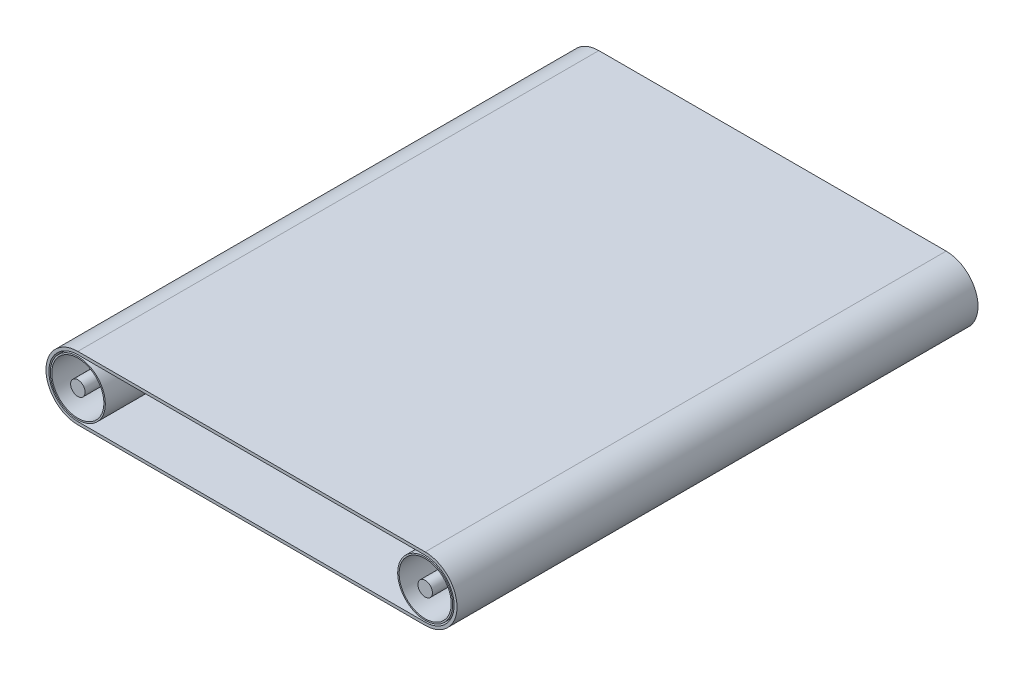
ISO-10303-21;
HEADER;
FILE_DESCRIPTION(('STEP AP214'),'2;1');
FILE_NAME('part.step','',(''),(''),'','','');
FILE_SCHEMA(('AUTOMOTIVE_DESIGN { 1 0 10303 214 1 1 1 1 }'));
ENDSEC;
DATA;
#1=APPLICATION_CONTEXT('core data for automotive mechanical design processes');
#2=APPLICATION_PROTOCOL_DEFINITION('international standard','automotive_design',2000,#1);
#3=PRODUCT_CONTEXT('',#1,'mechanical');
#4=PRODUCT('Part','Part','',(#3));
#5=PRODUCT_RELATED_PRODUCT_CATEGORY('part','',(#4));
#6=PRODUCT_DEFINITION_FORMATION('','',#4);
#7=PRODUCT_DEFINITION_CONTEXT('part definition',#1,'design');
#8=PRODUCT_DEFINITION('design','',#6,#7);
#9=PRODUCT_DEFINITION_SHAPE('','',#8);
#10=(LENGTH_UNIT() NAMED_UNIT(*) SI_UNIT(.MILLI.,.METRE.));
#11=(NAMED_UNIT(*) PLANE_ANGLE_UNIT() SI_UNIT($,.RADIAN.));
#12=(NAMED_UNIT(*) SI_UNIT($,.STERADIAN.) SOLID_ANGLE_UNIT());
#13=UNCERTAINTY_MEASURE_WITH_UNIT(LENGTH_MEASURE(1.E-05),#10,'distance_accuracy_value','');
#14=(GEOMETRIC_REPRESENTATION_CONTEXT(3) GLOBAL_UNCERTAINTY_ASSIGNED_CONTEXT((#13)) GLOBAL_UNIT_ASSIGNED_CONTEXT((#10,
#11,#12)) REPRESENTATION_CONTEXT('',''));
#15=CARTESIAN_POINT('',(0.,0.,0.));
#16=DIRECTION('',(0.,0.,1.));
#17=DIRECTION('',(1.,0.,0.));
#18=AXIS2_PLACEMENT_3D('',#15,#16,#17);
#19=CARTESIAN_POINT('',(120.,10.,0.));
#20=DIRECTION('',(0.,0.,1.));
#21=DIRECTION('',(1.,0.,0.));
#22=AXIS2_PLACEMENT_3D('',#19,#20,#21);
#23=CYLINDRICAL_SURFACE('',#22,9.5);
#24=CARTESIAN_POINT('',(120.,10.,0.));
#25=DIRECTION('',(0.,0.,1.));
#26=DIRECTION('',(-1.,0.,0.));
#27=AXIS2_PLACEMENT_3D('',#24,#25,#26);
#28=CIRCLE('',#27,9.5);
#29=CARTESIAN_POINT('',(110.5,10.,0.));
#30=VERTEX_POINT('',#29);
#31=EDGE_CURVE('E61',#30,#30,#28,.T.);
#32=ORIENTED_EDGE('',*,*,#31,.T.);
#33=EDGE_LOOP('',(#32));
#34=FACE_BOUND('',#33,.T.);
#35=CARTESIAN_POINT('',(120.,10.,180.));
#36=DIRECTION('',(0.,0.,1.));
#37=DIRECTION('',(-1.,0.,0.));
#38=AXIS2_PLACEMENT_3D('',#35,#36,#37);
#39=CIRCLE('',#38,9.5);
#40=CARTESIAN_POINT('',(110.5,10.,180.));
#41=VERTEX_POINT('',#40);
#42=EDGE_CURVE('E59',#41,#41,#39,.T.);
#43=ORIENTED_EDGE('',*,*,#42,.F.);
#44=EDGE_LOOP('',(#43));
#45=FACE_BOUND('',#44,.T.);
#46=ADVANCED_FACE('F48',(#34,#45),#23,.T.);
#47=CARTESIAN_POINT('',(120.,10.,0.));
#48=DIRECTION('',(0.,0.,-1.));
#49=DIRECTION('',(-1.,0.,0.));
#50=AXIS2_PLACEMENT_3D('',#47,#48,#49);
#51=PLANE('',#50);
#52=CARTESIAN_POINT('',(120.,10.,0.));
#53=DIRECTION('',(0.,0.,1.));
#54=DIRECTION('',(-1.,0.,0.));
#55=AXIS2_PLACEMENT_3D('',#52,#53,#54);
#56=CIRCLE('',#55,9.00000000000005);
#57=CARTESIAN_POINT('',(111.,10.,0.));
#58=VERTEX_POINT('',#57);
#59=EDGE_CURVE('E52',#58,#58,#56,.T.);
#60=ORIENTED_EDGE('',*,*,#59,.T.);
#61=EDGE_LOOP('',(#60));
#62=FACE_BOUND('',#61,.T.);
#63=ORIENTED_EDGE('',*,*,#31,.F.);
#64=EDGE_LOOP('',(#63));
#65=FACE_BOUND('',#64,.T.);
#66=ADVANCED_FACE('F70',(#62,#65),#51,.T.);
#67=CARTESIAN_POINT('',(120.,10.,180.));
#68=DIRECTION('',(0.,0.,-1.));
#69=DIRECTION('',(-1.,0.,0.));
#70=AXIS2_PLACEMENT_3D('',#67,#68,#69);
#71=PLANE('',#70);
#72=CARTESIAN_POINT('',(120.,10.,180.));
#73=DIRECTION('',(0.,0.,1.));
#74=DIRECTION('',(-1.,0.,0.));
#75=AXIS2_PLACEMENT_3D('',#72,#73,#74);
#76=CIRCLE('',#75,9.00000000000005);
#77=CARTESIAN_POINT('',(111.,10.,180.));
#78=VERTEX_POINT('',#77);
#79=EDGE_CURVE('E11',#78,#78,#76,.T.);
#80=ORIENTED_EDGE('',*,*,#79,.F.);
#81=EDGE_LOOP('',(#80));
#82=FACE_BOUND('',#81,.T.);
#83=ORIENTED_EDGE('',*,*,#42,.T.);
#84=EDGE_LOOP('',(#83));
#85=FACE_BOUND('',#84,.T.);
#86=ADVANCED_FACE('F67',(#82,#85),#71,.F.);
#87=CARTESIAN_POINT('',(120.,10.,0.));
#88=DIRECTION('',(0.,0.,1.));
#89=DIRECTION('',(1.,0.,0.));
#90=AXIS2_PLACEMENT_3D('',#87,#88,#89);
#91=CYLINDRICAL_SURFACE('',#90,9.00000000000005);
#92=ORIENTED_EDGE('',*,*,#59,.F.);
#93=EDGE_LOOP('',(#92));
#94=FACE_BOUND('',#93,.T.);
#95=ORIENTED_EDGE('',*,*,#79,.T.);
#96=EDGE_LOOP('',(#95));
#97=FACE_BOUND('',#96,.T.);
#98=ADVANCED_FACE('F50',(#94,#97),#91,.F.);
#99=CLOSED_SHELL('',(#46,#66,#86,#98));
#100=MANIFOLD_SOLID_BREP('B2',#99);
#101=CARTESIAN_POINT('',(0.,10.,0.));
#102=DIRECTION('',(0.,0.,1.));
#103=DIRECTION('',(1.,0.,0.));
#104=AXIS2_PLACEMENT_3D('',#101,#102,#103);
#105=CYLINDRICAL_SURFACE('',#104,9.5);
#106=CARTESIAN_POINT('',(0.,10.,0.));
#107=DIRECTION('',(0.,0.,1.));
#108=DIRECTION('',(1.,0.,0.));
#109=AXIS2_PLACEMENT_3D('',#106,#107,#108);
#110=CIRCLE('',#109,9.5);
#111=CARTESIAN_POINT('',(9.5,10.,0.));
#112=VERTEX_POINT('',#111);
#113=EDGE_CURVE('E47',#112,#112,#110,.T.);
#114=ORIENTED_EDGE('',*,*,#113,.T.);
#115=EDGE_LOOP('',(#114));
#116=FACE_BOUND('',#115,.T.);
#117=CARTESIAN_POINT('',(0.,10.,180.));
#118=DIRECTION('',(0.,0.,1.));
#119=DIRECTION('',(1.,0.,0.));
#120=AXIS2_PLACEMENT_3D('',#117,#118,#119);
#121=CIRCLE('',#120,9.5);
#122=CARTESIAN_POINT('',(9.5,10.,180.));
#123=VERTEX_POINT('',#122);
#124=EDGE_CURVE('E129',#123,#123,#121,.T.);
#125=ORIENTED_EDGE('',*,*,#124,.F.);
#126=EDGE_LOOP('',(#125));
#127=FACE_BOUND('',#126,.T.);
#128=ADVANCED_FACE('F126',(#116,#127),#105,.T.);
#129=CARTESIAN_POINT('',(0.,10.,0.));
#130=DIRECTION('',(0.,0.,1.));
#131=DIRECTION('',(1.,0.,0.));
#132=AXIS2_PLACEMENT_3D('',#129,#130,#131);
#133=PLANE('',#132);
#134=CARTESIAN_POINT('',(0.,10.,0.));
#135=DIRECTION('',(0.,0.,1.));
#136=DIRECTION('',(1.,0.,0.));
#137=AXIS2_PLACEMENT_3D('',#134,#135,#136);
#138=CIRCLE('',#137,9.);
#139=CARTESIAN_POINT('',(9.,10.,0.));
#140=VERTEX_POINT('',#139);
#141=EDGE_CURVE('E136',#140,#140,#138,.T.);
#142=ORIENTED_EDGE('',*,*,#141,.T.);
#143=EDGE_LOOP('',(#142));
#144=FACE_BOUND('',#143,.T.);
#145=ORIENTED_EDGE('',*,*,#113,.F.);
#146=EDGE_LOOP('',(#145));
#147=FACE_BOUND('',#146,.T.);
#148=ADVANCED_FACE('F144',(#144,#147),#133,.F.);
#149=CARTESIAN_POINT('',(0.,10.,180.));
#150=DIRECTION('',(0.,0.,1.));
#151=DIRECTION('',(1.,0.,0.));
#152=AXIS2_PLACEMENT_3D('',#149,#150,#151);
#153=PLANE('',#152);
#154=CARTESIAN_POINT('',(0.,10.,180.));
#155=DIRECTION('',(0.,0.,1.));
#156=DIRECTION('',(1.,0.,0.));
#157=AXIS2_PLACEMENT_3D('',#154,#155,#156);
#158=CIRCLE('',#157,9.);
#159=CARTESIAN_POINT('',(9.,10.,180.));
#160=VERTEX_POINT('',#159);
#161=EDGE_CURVE('E138',#160,#160,#158,.T.);
#162=ORIENTED_EDGE('',*,*,#161,.F.);
#163=EDGE_LOOP('',(#162));
#164=FACE_BOUND('',#163,.T.);
#165=ORIENTED_EDGE('',*,*,#124,.T.);
#166=EDGE_LOOP('',(#165));
#167=FACE_BOUND('',#166,.T.);
#168=ADVANCED_FACE('F150',(#164,#167),#153,.T.);
#169=CARTESIAN_POINT('',(0.,10.,0.));
#170=DIRECTION('',(0.,0.,1.));
#171=DIRECTION('',(1.,0.,0.));
#172=AXIS2_PLACEMENT_3D('',#169,#170,#171);
#173=CYLINDRICAL_SURFACE('',#172,9.);
#174=ORIENTED_EDGE('',*,*,#141,.F.);
#175=EDGE_LOOP('',(#174));
#176=FACE_BOUND('',#175,.T.);
#177=ORIENTED_EDGE('',*,*,#161,.T.);
#178=EDGE_LOOP('',(#177));
#179=FACE_BOUND('',#178,.T.);
#180=ADVANCED_FACE('F147',(#176,#179),#173,.F.);
#181=CLOSED_SHELL('',(#128,#148,#168,#180));
#182=MANIFOLD_SOLID_BREP('B6',#181);
#183=CARTESIAN_POINT('',(120.,10.,0.));
#184=DIRECTION('',(0.,0.,1.));
#185=DIRECTION('',(1.,0.,0.));
#186=AXIS2_PLACEMENT_3D('',#183,#184,#185);
#187=CYLINDRICAL_SURFACE('',#186,2.49999999999997);
#188=CARTESIAN_POINT('',(120.,10.,0.));
#189=DIRECTION('',(0.,0.,1.));
#190=DIRECTION('',(-1.,0.,0.));
#191=AXIS2_PLACEMENT_3D('',#188,#189,#190);
#192=CIRCLE('',#191,2.49999999999997);
#193=CARTESIAN_POINT('',(117.5,10.,0.));
#194=VERTEX_POINT('',#193);
#195=EDGE_CURVE('E208',#194,#194,#192,.T.);
#196=ORIENTED_EDGE('',*,*,#195,.T.);
#197=EDGE_LOOP('',(#196));
#198=FACE_BOUND('',#197,.T.);
#199=CARTESIAN_POINT('',(120.,10.,180.));
#200=DIRECTION('',(0.,0.,1.));
#201=DIRECTION('',(-1.,0.,0.));
#202=AXIS2_PLACEMENT_3D('',#199,#200,#201);
#203=CIRCLE('',#202,2.49999999999997);
#204=CARTESIAN_POINT('',(117.5,10.,180.));
#205=VERTEX_POINT('',#204);
#206=EDGE_CURVE('E125',#205,#205,#203,.T.);
#207=ORIENTED_EDGE('',*,*,#206,.F.);
#208=EDGE_LOOP('',(#207));
#209=FACE_BOUND('',#208,.T.);
#210=ADVANCED_FACE('F204',(#198,#209),#187,.T.);
#211=CARTESIAN_POINT('',(120.,10.,0.));
#212=DIRECTION('',(0.,0.,-1.));
#213=DIRECTION('',(-1.,0.,0.));
#214=AXIS2_PLACEMENT_3D('',#211,#212,#213);
#215=PLANE('',#214);
#216=ORIENTED_EDGE('',*,*,#195,.F.);
#217=EDGE_LOOP('',(#216));
#218=FACE_BOUND('',#217,.T.);
#219=ADVANCED_FACE('F206',(#218),#215,.T.);
#220=CARTESIAN_POINT('',(120.,10.,180.));
#221=DIRECTION('',(0.,0.,-1.));
#222=DIRECTION('',(-1.,0.,0.));
#223=AXIS2_PLACEMENT_3D('',#220,#221,#222);
#224=PLANE('',#223);
#225=ORIENTED_EDGE('',*,*,#206,.T.);
#226=EDGE_LOOP('',(#225));
#227=FACE_BOUND('',#226,.T.);
#228=ADVANCED_FACE('F220',(#227),#224,.F.);
#229=CLOSED_SHELL('',(#210,#219,#228));
#230=MANIFOLD_SOLID_BREP('B42',#229);
#231=CARTESIAN_POINT('',(0.,10.,0.));
#232=DIRECTION('',(0.,0.,1.));
#233=DIRECTION('',(1.,0.,0.));
#234=AXIS2_PLACEMENT_3D('',#231,#232,#233);
#235=CYLINDRICAL_SURFACE('',#234,2.5);
#236=CARTESIAN_POINT('',(0.,10.,0.));
#237=DIRECTION('',(0.,0.,1.));
#238=DIRECTION('',(1.,0.,0.));
#239=AXIS2_PLACEMENT_3D('',#236,#237,#238);
#240=CIRCLE('',#239,2.5);
#241=CARTESIAN_POINT('',(2.5,10.,0.));
#242=VERTEX_POINT('',#241);
#243=EDGE_CURVE('E203',#242,#242,#240,.T.);
#244=ORIENTED_EDGE('',*,*,#243,.T.);
#245=EDGE_LOOP('',(#244));
#246=FACE_BOUND('',#245,.T.);
#247=CARTESIAN_POINT('',(0.,10.,180.));
#248=DIRECTION('',(0.,0.,1.));
#249=DIRECTION('',(1.,0.,0.));
#250=AXIS2_PLACEMENT_3D('',#247,#248,#249);
#251=CIRCLE('',#250,2.5);
#252=CARTESIAN_POINT('',(2.5,10.,180.));
#253=VERTEX_POINT('',#252);
#254=EDGE_CURVE('E263',#253,#253,#251,.T.);
#255=ORIENTED_EDGE('',*,*,#254,.F.);
#256=EDGE_LOOP('',(#255));
#257=FACE_BOUND('',#256,.T.);
#258=ADVANCED_FACE('F260',(#246,#257),#235,.T.);
#259=CARTESIAN_POINT('',(0.,10.,0.));
#260=DIRECTION('',(0.,0.,1.));
#261=DIRECTION('',(1.,0.,0.));
#262=AXIS2_PLACEMENT_3D('',#259,#260,#261);
#263=PLANE('',#262);
#264=ORIENTED_EDGE('',*,*,#243,.F.);
#265=EDGE_LOOP('',(#264));
#266=FACE_BOUND('',#265,.T.);
#267=ADVANCED_FACE('F275',(#266),#263,.F.);
#268=CARTESIAN_POINT('',(0.,10.,180.));
#269=DIRECTION('',(0.,0.,1.));
#270=DIRECTION('',(1.,0.,0.));
#271=AXIS2_PLACEMENT_3D('',#268,#269,#270);
#272=PLANE('',#271);
#273=ORIENTED_EDGE('',*,*,#254,.T.);
#274=EDGE_LOOP('',(#273));
#275=FACE_BOUND('',#274,.T.);
#276=ADVANCED_FACE('F272',(#275),#272,.T.);
#277=CLOSED_SHELL('',(#258,#267,#276));
#278=MANIFOLD_SOLID_BREP('B120',#277);
#279=CARTESIAN_POINT('',(0.,9.99999999999996,180.));
#280=DIRECTION('',(0.,0.,-1.));
#281=DIRECTION('',(-1.,0.,0.));
#282=AXIS2_PLACEMENT_3D('',#279,#280,#281);
#283=PLANE('',#282);
#284=CARTESIAN_POINT('',(0.,9.99999999999996,180.));
#285=DIRECTION('',(0.,0.,1.));
#286=DIRECTION('',(-1.,0.,0.));
#287=AXIS2_PLACEMENT_3D('',#284,#285,#286);
#288=CIRCLE('',#287,11.);
#289=CARTESIAN_POINT('',(0.,21.,180.));
#290=VERTEX_POINT('',#289);
#291=CARTESIAN_POINT('',(0.,-1.00000000000004,180.));
#292=VERTEX_POINT('',#291);
#293=EDGE_CURVE('E408',#290,#292,#288,.T.);
#294=ORIENTED_EDGE('',*,*,#293,.T.);
#295=DIRECTION('',(1.,0.,0.));
#296=VECTOR('',#295,1.);
#297=CARTESIAN_POINT('',(120.,-1.,180.));
#298=LINE('',#297,#296);
#299=CARTESIAN_POINT('',(120.,-0.999999999999999,180.));
#300=VERTEX_POINT('',#299);
#301=EDGE_CURVE('E411',#292,#300,#298,.T.);
#302=ORIENTED_EDGE('',*,*,#301,.T.);
#303=CARTESIAN_POINT('',(120.,9.99999999999999,180.));
#304=DIRECTION('',(0.,0.,1.));
#305=DIRECTION('',(-1.,0.,0.));
#306=AXIS2_PLACEMENT_3D('',#303,#304,#305);
#307=CIRCLE('',#306,11.);
#308=CARTESIAN_POINT('',(120.,21.,180.));
#309=VERTEX_POINT('',#308);
#310=EDGE_CURVE('E414',#300,#309,#307,.T.);
#311=ORIENTED_EDGE('',*,*,#310,.T.);
#312=DIRECTION('',(-1.,0.,0.));
#313=VECTOR('',#312,1.);
#314=CARTESIAN_POINT('',(0.,21.,180.));
#315=LINE('',#314,#313);
#316=EDGE_CURVE('E416',#309,#290,#315,.T.);
#317=ORIENTED_EDGE('',*,*,#316,.T.);
#318=EDGE_LOOP('',(#294,#302,#311,#317));
#319=FACE_BOUND('',#318,.T.);
#320=CARTESIAN_POINT('',(0.,10.,180.));
#321=DIRECTION('',(0.,0.,1.));
#322=DIRECTION('',(1.,0.,0.));
#323=AXIS2_PLACEMENT_3D('',#320,#321,#322);
#324=CIRCLE('',#323,10.);
#325=CARTESIAN_POINT('',(0.,20.,180.));
#326=VERTEX_POINT('',#325);
#327=CARTESIAN_POINT('',(0.,0.,180.));
#328=VERTEX_POINT('',#327);
#329=EDGE_CURVE('E372',#326,#328,#324,.T.);
#330=ORIENTED_EDGE('',*,*,#329,.F.);
#331=DIRECTION('',(-1.,0.,0.));
#332=VECTOR('',#331,1.);
#333=CARTESIAN_POINT('',(120.,20.,180.));
#334=LINE('',#333,#332);
#335=CARTESIAN_POINT('',(120.,20.,180.));
#336=VERTEX_POINT('',#335);
#337=EDGE_CURVE('E394',#336,#326,#334,.T.);
#338=ORIENTED_EDGE('',*,*,#337,.F.);
#339=CARTESIAN_POINT('',(120.,10.,180.));
#340=DIRECTION('',(0.,0.,1.));
#341=DIRECTION('',(1.,0.,0.));
#342=AXIS2_PLACEMENT_3D('',#339,#340,#341);
#343=CIRCLE('',#342,10.);
#344=CARTESIAN_POINT('',(120.,0.,180.));
#345=VERTEX_POINT('',#344);
#346=EDGE_CURVE('E392',#345,#336,#343,.T.);
#347=ORIENTED_EDGE('',*,*,#346,.F.);
#348=DIRECTION('',(1.,0.,0.));
#349=VECTOR('',#348,1.);
#350=CARTESIAN_POINT('',(0.,0.,180.));
#351=LINE('',#350,#349);
#352=EDGE_CURVE('E380',#328,#345,#351,.T.);
#353=ORIENTED_EDGE('',*,*,#352,.F.);
#354=EDGE_LOOP('',(#330,#338,#347,#353));
#355=FACE_BOUND('',#354,.T.);
#356=ADVANCED_FACE('F307',(#319,#355),#283,.F.);
#357=CARTESIAN_POINT('',(0.,9.99999999999996,0.));
#358=DIRECTION('',(0.,0.,-1.));
#359=DIRECTION('',(-1.,0.,0.));
#360=AXIS2_PLACEMENT_3D('',#357,#358,#359);
#361=PLANE('',#360);
#362=CARTESIAN_POINT('',(0.,9.99999999999996,0.));
#363=DIRECTION('',(0.,0.,1.));
#364=DIRECTION('',(-1.,0.,0.));
#365=AXIS2_PLACEMENT_3D('',#362,#363,#364);
#366=CIRCLE('',#365,11.);
#367=CARTESIAN_POINT('',(0.,21.,0.));
#368=VERTEX_POINT('',#367);
#369=CARTESIAN_POINT('',(0.,-1.00000000000004,0.));
#370=VERTEX_POINT('',#369);
#371=EDGE_CURVE('E388',#368,#370,#366,.T.);
#372=ORIENTED_EDGE('',*,*,#371,.F.);
#373=DIRECTION('',(-1.,0.,0.));
#374=VECTOR('',#373,1.);
#375=CARTESIAN_POINT('',(0.,21.,0.));
#376=LINE('',#375,#374);
#377=CARTESIAN_POINT('',(120.,21.,0.));
#378=VERTEX_POINT('',#377);
#379=EDGE_CURVE('E412',#378,#368,#376,.T.);
#380=ORIENTED_EDGE('',*,*,#379,.F.);
#381=CARTESIAN_POINT('',(120.,9.99999999999999,0.));
#382=DIRECTION('',(0.,0.,1.));
#383=DIRECTION('',(-1.,0.,0.));
#384=AXIS2_PLACEMENT_3D('',#381,#382,#383);
#385=CIRCLE('',#384,11.);
#386=CARTESIAN_POINT('',(120.,-0.999999999999999,0.));
#387=VERTEX_POINT('',#386);
#388=EDGE_CURVE('E423',#387,#378,#385,.T.);
#389=ORIENTED_EDGE('',*,*,#388,.F.);
#390=DIRECTION('',(1.,0.,0.));
#391=VECTOR('',#390,1.);
#392=CARTESIAN_POINT('',(120.,-1.,0.));
#393=LINE('',#392,#391);
#394=EDGE_CURVE('E421',#370,#387,#393,.T.);
#395=ORIENTED_EDGE('',*,*,#394,.F.);
#396=EDGE_LOOP('',(#372,#380,#389,#395));
#397=FACE_BOUND('',#396,.T.);
#398=DIRECTION('',(-1.,0.,0.));
#399=VECTOR('',#398,1.);
#400=CARTESIAN_POINT('',(120.,20.,0.));
#401=LINE('',#400,#399);
#402=CARTESIAN_POINT('',(120.,20.,0.));
#403=VERTEX_POINT('',#402);
#404=CARTESIAN_POINT('',(0.,20.,0.));
#405=VERTEX_POINT('',#404);
#406=EDGE_CURVE('E381',#403,#405,#401,.T.);
#407=ORIENTED_EDGE('',*,*,#406,.T.);
#408=CARTESIAN_POINT('',(0.,10.,0.));
#409=DIRECTION('',(0.,0.,1.));
#410=DIRECTION('',(1.,0.,0.));
#411=AXIS2_PLACEMENT_3D('',#408,#409,#410);
#412=CIRCLE('',#411,10.);
#413=CARTESIAN_POINT('',(0.,0.,0.));
#414=VERTEX_POINT('',#413);
#415=EDGE_CURVE('E330',#405,#414,#412,.T.);
#416=ORIENTED_EDGE('',*,*,#415,.T.);
#417=DIRECTION('',(1.,0.,0.));
#418=VECTOR('',#417,1.);
#419=CARTESIAN_POINT('',(0.,0.,0.));
#420=LINE('',#419,#418);
#421=CARTESIAN_POINT('',(120.,0.,0.));
#422=VERTEX_POINT('',#421);
#423=EDGE_CURVE('E387',#414,#422,#420,.T.);
#424=ORIENTED_EDGE('',*,*,#423,.T.);
#425=CARTESIAN_POINT('',(120.,10.,0.));
#426=DIRECTION('',(0.,0.,1.));
#427=DIRECTION('',(1.,0.,0.));
#428=AXIS2_PLACEMENT_3D('',#425,#426,#427);
#429=CIRCLE('',#428,10.);
#430=EDGE_CURVE('E400',#422,#403,#429,.T.);
#431=ORIENTED_EDGE('',*,*,#430,.T.);
#432=EDGE_LOOP('',(#407,#416,#424,#431));
#433=FACE_BOUND('',#432,.T.);
#434=ADVANCED_FACE('F441',(#397,#433),#361,.T.);
#435=CARTESIAN_POINT('',(0.,9.99999999999996,180.));
#436=DIRECTION('',(0.,0.,-1.));
#437=DIRECTION('',(-1.,0.,0.));
#438=AXIS2_PLACEMENT_3D('',#435,#436,#437);
#439=CYLINDRICAL_SURFACE('',#438,11.);
#440=ORIENTED_EDGE('',*,*,#371,.T.);
#441=DIRECTION('',(0.,0.,-1.));
#442=VECTOR('',#441,1.);
#443=CARTESIAN_POINT('',(0.,-1.00000000000004,180.));
#444=LINE('',#443,#442);
#445=EDGE_CURVE('E258',#292,#370,#444,.T.);
#446=ORIENTED_EDGE('',*,*,#445,.F.);
#447=ORIENTED_EDGE('',*,*,#293,.F.);
#448=DIRECTION('',(0.,0.,-1.));
#449=VECTOR('',#448,1.);
#450=CARTESIAN_POINT('',(0.,21.,180.));
#451=LINE('',#450,#449);
#452=EDGE_CURVE('E418',#290,#368,#451,.T.);
#453=ORIENTED_EDGE('',*,*,#452,.T.);
#454=EDGE_LOOP('',(#440,#446,#447,#453));
#455=FACE_BOUND('',#454,.T.);
#456=ADVANCED_FACE('F309',(#455),#439,.T.);
#457=CARTESIAN_POINT('',(120.,-1.,180.));
#458=DIRECTION('',(0.,1.,0.));
#459=DIRECTION('',(-1.,0.,0.));
#460=AXIS2_PLACEMENT_3D('',#457,#458,#459);
#461=PLANE('',#460);
#462=ORIENTED_EDGE('',*,*,#394,.T.);
#463=DIRECTION('',(0.,0.,-1.));
#464=VECTOR('',#463,1.);
#465=CARTESIAN_POINT('',(120.,-0.999999999999999,180.));
#466=LINE('',#465,#464);
#467=EDGE_CURVE('E315',#300,#387,#466,.T.);
#468=ORIENTED_EDGE('',*,*,#467,.F.);
#469=ORIENTED_EDGE('',*,*,#301,.F.);
#470=ORIENTED_EDGE('',*,*,#445,.T.);
#471=EDGE_LOOP('',(#462,#468,#469,#470));
#472=FACE_BOUND('',#471,.T.);
#473=ADVANCED_FACE('F451',(#472),#461,.F.);
#474=CARTESIAN_POINT('',(120.,9.99999999999999,180.));
#475=DIRECTION('',(0.,0.,-1.));
#476=DIRECTION('',(-1.,0.,0.));
#477=AXIS2_PLACEMENT_3D('',#474,#475,#476);
#478=CYLINDRICAL_SURFACE('',#477,11.);
#479=ORIENTED_EDGE('',*,*,#388,.T.);
#480=DIRECTION('',(0.,0.,-1.));
#481=VECTOR('',#480,1.);
#482=CARTESIAN_POINT('',(120.,21.,180.));
#483=LINE('',#482,#481);
#484=EDGE_CURVE('E428',#309,#378,#483,.T.);
#485=ORIENTED_EDGE('',*,*,#484,.F.);
#486=ORIENTED_EDGE('',*,*,#310,.F.);
#487=ORIENTED_EDGE('',*,*,#467,.T.);
#488=EDGE_LOOP('',(#479,#485,#486,#487));
#489=FACE_BOUND('',#488,.T.);
#490=ADVANCED_FACE('F435',(#489),#478,.T.);
#491=CARTESIAN_POINT('',(0.,21.,180.));
#492=DIRECTION('',(0.,-1.,0.));
#493=DIRECTION('',(1.,0.,0.));
#494=AXIS2_PLACEMENT_3D('',#491,#492,#493);
#495=PLANE('',#494);
#496=ORIENTED_EDGE('',*,*,#379,.T.);
#497=ORIENTED_EDGE('',*,*,#452,.F.);
#498=ORIENTED_EDGE('',*,*,#316,.F.);
#499=ORIENTED_EDGE('',*,*,#484,.T.);
#500=EDGE_LOOP('',(#496,#497,#498,#499));
#501=FACE_BOUND('',#500,.T.);
#502=ADVANCED_FACE('F445',(#501),#495,.F.);
#503=CARTESIAN_POINT('',(0.,10.,180.));
#504=DIRECTION('',(0.,0.,-1.));
#505=DIRECTION('',(-1.,0.,0.));
#506=AXIS2_PLACEMENT_3D('',#503,#504,#505);
#507=CYLINDRICAL_SURFACE('',#506,10.);
#508=ORIENTED_EDGE('',*,*,#415,.F.);
#509=DIRECTION('',(0.,0.,-1.));
#510=VECTOR('',#509,1.);
#511=CARTESIAN_POINT('',(0.,20.,180.));
#512=LINE('',#511,#510);
#513=EDGE_CURVE('E376',#326,#405,#512,.T.);
#514=ORIENTED_EDGE('',*,*,#513,.F.);
#515=ORIENTED_EDGE('',*,*,#329,.T.);
#516=DIRECTION('',(0.,0.,-1.));
#517=VECTOR('',#516,1.);
#518=CARTESIAN_POINT('',(0.,0.,180.));
#519=LINE('',#518,#517);
#520=EDGE_CURVE('E375',#328,#414,#519,.T.);
#521=ORIENTED_EDGE('',*,*,#520,.T.);
#522=EDGE_LOOP('',(#508,#514,#515,#521));
#523=FACE_BOUND('',#522,.T.);
#524=ADVANCED_FACE('F374',(#523),#507,.F.);
#525=CARTESIAN_POINT('',(0.,0.,180.));
#526=DIRECTION('',(0.,1.,0.));
#527=DIRECTION('',(0.,0.,1.));
#528=AXIS2_PLACEMENT_3D('',#525,#526,#527);
#529=PLANE('',#528);
#530=ORIENTED_EDGE('',*,*,#423,.F.);
#531=ORIENTED_EDGE('',*,*,#520,.F.);
#532=ORIENTED_EDGE('',*,*,#352,.T.);
#533=DIRECTION('',(0.,0.,-1.));
#534=VECTOR('',#533,1.);
#535=CARTESIAN_POINT('',(120.,0.,180.));
#536=LINE('',#535,#534);
#537=EDGE_CURVE('E389',#345,#422,#536,.T.);
#538=ORIENTED_EDGE('',*,*,#537,.T.);
#539=EDGE_LOOP('',(#530,#531,#532,#538));
#540=FACE_BOUND('',#539,.T.);
#541=ADVANCED_FACE('F384',(#540),#529,.T.);
#542=CARTESIAN_POINT('',(120.,10.,180.));
#543=DIRECTION('',(0.,0.,-1.));
#544=DIRECTION('',(-1.,0.,0.));
#545=AXIS2_PLACEMENT_3D('',#542,#543,#544);
#546=CYLINDRICAL_SURFACE('',#545,10.);
#547=ORIENTED_EDGE('',*,*,#430,.F.);
#548=ORIENTED_EDGE('',*,*,#537,.F.);
#549=ORIENTED_EDGE('',*,*,#346,.T.);
#550=DIRECTION('',(0.,0.,-1.));
#551=VECTOR('',#550,1.);
#552=CARTESIAN_POINT('',(120.,20.,180.));
#553=LINE('',#552,#551);
#554=EDGE_CURVE('E322',#336,#403,#553,.T.);
#555=ORIENTED_EDGE('',*,*,#554,.T.);
#556=EDGE_LOOP('',(#547,#548,#549,#555));
#557=FACE_BOUND('',#556,.T.);
#558=ADVANCED_FACE('F474',(#557),#546,.F.);
#559=CARTESIAN_POINT('',(120.,20.,180.));
#560=DIRECTION('',(0.,-1.,0.));
#561=DIRECTION('',(0.,0.,-1.));
#562=AXIS2_PLACEMENT_3D('',#559,#560,#561);
#563=PLANE('',#562);
#564=ORIENTED_EDGE('',*,*,#406,.F.);
#565=ORIENTED_EDGE('',*,*,#554,.F.);
#566=ORIENTED_EDGE('',*,*,#337,.T.);
#567=ORIENTED_EDGE('',*,*,#513,.T.);
#568=EDGE_LOOP('',(#564,#565,#566,#567));
#569=FACE_BOUND('',#568,.T.);
#570=ADVANCED_FACE('F478',(#569),#563,.T.);
#571=CLOSED_SHELL('',(#356,#434,#456,#473,#490,#502,#524,#541,#558,#570));
#572=MANIFOLD_SOLID_BREP('B198',#571);
#573=ADVANCED_BREP_SHAPE_REPRESENTATION('',(#18,#100,#182,#230,#278,#572),#14);
#574=SHAPE_DEFINITION_REPRESENTATION(#9,#573);
ENDSEC;
END-ISO-10303-21;
